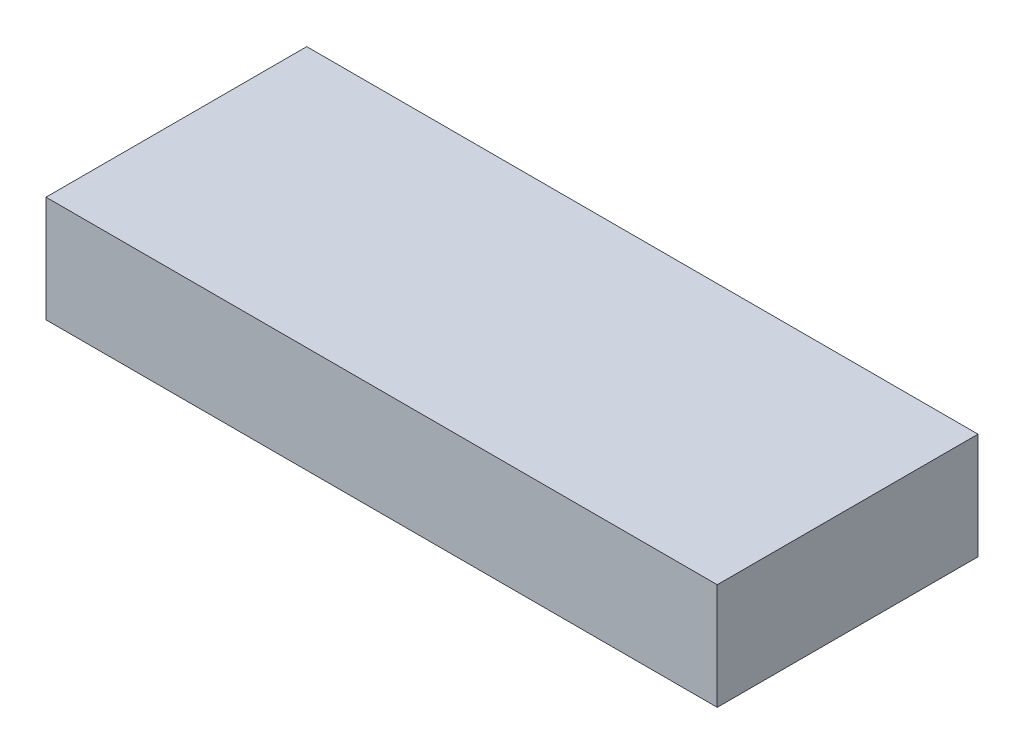
ISO-10303-21;
HEADER;
FILE_DESCRIPTION(('STEP AP214'),'2;1');
FILE_NAME('part.step','',(''),(''),'','','');
FILE_SCHEMA(('AUTOMOTIVE_DESIGN { 1 0 10303 214 1 1 1 1 }'));
ENDSEC;
DATA;
#1=APPLICATION_CONTEXT('core data for automotive mechanical design processes');
#2=APPLICATION_PROTOCOL_DEFINITION('international standard','automotive_design',2000,#1);
#3=PRODUCT_CONTEXT('',#1,'mechanical');
#4=PRODUCT('Part','Part','',(#3));
#5=PRODUCT_RELATED_PRODUCT_CATEGORY('part','',(#4));
#6=PRODUCT_DEFINITION_FORMATION('','',#4);
#7=PRODUCT_DEFINITION_CONTEXT('part definition',#1,'design');
#8=PRODUCT_DEFINITION('design','',#6,#7);
#9=PRODUCT_DEFINITION_SHAPE('','',#8);
#10=(LENGTH_UNIT() NAMED_UNIT(*) SI_UNIT(.MILLI.,.METRE.));
#11=(NAMED_UNIT(*) PLANE_ANGLE_UNIT() SI_UNIT($,.RADIAN.));
#12=(NAMED_UNIT(*) SI_UNIT($,.STERADIAN.) SOLID_ANGLE_UNIT());
#13=UNCERTAINTY_MEASURE_WITH_UNIT(LENGTH_MEASURE(1.E-05),#10,'distance_accuracy_value','');
#14=(GEOMETRIC_REPRESENTATION_CONTEXT(3) GLOBAL_UNCERTAINTY_ASSIGNED_CONTEXT((#13)) GLOBAL_UNIT_ASSIGNED_CONTEXT((#10,
#11,#12)) REPRESENTATION_CONTEXT('',''));
#15=CARTESIAN_POINT('',(0.,0.,0.));
#16=DIRECTION('',(0.,0.,1.));
#17=DIRECTION('',(1.,0.,0.));
#18=AXIS2_PLACEMENT_3D('',#15,#16,#17);
#19=CARTESIAN_POINT('',(-63.1856138719376,20.,-24.54560632862));
#20=DIRECTION('',(1.,0.,0.));
#21=DIRECTION('',(0.,0.,-1.));
#22=AXIS2_PLACEMENT_3D('',#19,#20,#21);
#23=PLANE('',#22);
#24=DIRECTION('',(0.,0.,1.));
#25=VECTOR('',#24,1.);
#26=CARTESIAN_POINT('',(-63.1856138719376,0.,-24.54560632862));
#27=LINE('',#26,#25);
#28=CARTESIAN_POINT('',(-63.1856138719376,0.,-24.54560632862));
#29=VERTEX_POINT('',#28);
#30=CARTESIAN_POINT('',(-63.1856138719376,0.,24.54560632862));
#31=VERTEX_POINT('',#30);
#32=EDGE_CURVE('E96',#29,#31,#27,.T.);
#33=ORIENTED_EDGE('',*,*,#32,.T.);
#34=DIRECTION('',(0.,-1.,0.));
#35=VECTOR('',#34,1.);
#36=CARTESIAN_POINT('',(-63.1856138719376,20.,24.54560632862));
#37=LINE('',#36,#35);
#38=CARTESIAN_POINT('',(-63.1856138719376,20.,24.54560632862));
#39=VERTEX_POINT('',#38);
#40=EDGE_CURVE('E11',#39,#31,#37,.T.);
#41=ORIENTED_EDGE('',*,*,#40,.F.);
#42=DIRECTION('',(0.,0.,1.));
#43=VECTOR('',#42,1.);
#44=CARTESIAN_POINT('',(-63.1856138719376,20.,-24.54560632862));
#45=LINE('',#44,#43);
#46=CARTESIAN_POINT('',(-63.1856138719376,20.,-24.54560632862));
#47=VERTEX_POINT('',#46);
#48=EDGE_CURVE('E84',#47,#39,#45,.T.);
#49=ORIENTED_EDGE('',*,*,#48,.F.);
#50=DIRECTION('',(0.,-1.,0.));
#51=VECTOR('',#50,1.);
#52=CARTESIAN_POINT('',(-63.1856138719376,20.,-24.54560632862));
#53=LINE('',#52,#51);
#54=EDGE_CURVE('E92',#47,#29,#53,.T.);
#55=ORIENTED_EDGE('',*,*,#54,.T.);
#56=EDGE_LOOP('',(#33,#41,#49,#55));
#57=FACE_BOUND('',#56,.T.);
#58=ADVANCED_FACE('F33',(#57),#23,.F.);
#59=CARTESIAN_POINT('',(63.1856138719376,20.,24.54560632862));
#60=DIRECTION('',(0.,0.,-1.));
#61=DIRECTION('',(-1.,0.,0.));
#62=AXIS2_PLACEMENT_3D('',#59,#60,#61);
#63=PLANE('',#62);
#64=DIRECTION('',(1.,0.,0.));
#65=VECTOR('',#64,1.);
#66=CARTESIAN_POINT('',(63.1856138719376,0.,24.54560632862));
#67=LINE('',#66,#65);
#68=CARTESIAN_POINT('',(63.1856138719376,0.,24.54560632862));
#69=VERTEX_POINT('',#68);
#70=EDGE_CURVE('E88',#31,#69,#67,.T.);
#71=ORIENTED_EDGE('',*,*,#70,.T.);
#72=DIRECTION('',(0.,-1.,0.));
#73=VECTOR('',#72,1.);
#74=CARTESIAN_POINT('',(63.1856138719376,20.,24.54560632862));
#75=LINE('',#74,#73);
#76=CARTESIAN_POINT('',(63.1856138719376,20.,24.54560632862));
#77=VERTEX_POINT('',#76);
#78=EDGE_CURVE('E41',#77,#69,#75,.T.);
#79=ORIENTED_EDGE('',*,*,#78,.F.);
#80=DIRECTION('',(1.,0.,0.));
#81=VECTOR('',#80,1.);
#82=CARTESIAN_POINT('',(63.1856138719376,20.,24.54560632862));
#83=LINE('',#82,#81);
#84=EDGE_CURVE('E79',#39,#77,#83,.T.);
#85=ORIENTED_EDGE('',*,*,#84,.F.);
#86=ORIENTED_EDGE('',*,*,#40,.T.);
#87=EDGE_LOOP('',(#71,#79,#85,#86));
#88=FACE_BOUND('',#87,.T.);
#89=ADVANCED_FACE('F87',(#88),#63,.F.);
#90=CARTESIAN_POINT('',(63.1856138719376,20.,-24.54560632862));
#91=DIRECTION('',(-1.,0.,0.));
#92=DIRECTION('',(0.,0.,1.));
#93=AXIS2_PLACEMENT_3D('',#90,#91,#92);
#94=PLANE('',#93);
#95=DIRECTION('',(0.,0.,-1.));
#96=VECTOR('',#95,1.);
#97=CARTESIAN_POINT('',(63.1856138719376,0.,-24.54560632862));
#98=LINE('',#97,#96);
#99=CARTESIAN_POINT('',(63.1856138719376,0.,-24.54560632862));
#100=VERTEX_POINT('',#99);
#101=EDGE_CURVE('E66',#69,#100,#98,.T.);
#102=ORIENTED_EDGE('',*,*,#101,.T.);
#103=DIRECTION('',(0.,-1.,0.));
#104=VECTOR('',#103,1.);
#105=CARTESIAN_POINT('',(63.1856138719376,20.,-24.54560632862));
#106=LINE('',#105,#104);
#107=CARTESIAN_POINT('',(63.1856138719376,20.,-24.54560632862));
#108=VERTEX_POINT('',#107);
#109=EDGE_CURVE('E89',#108,#100,#106,.T.);
#110=ORIENTED_EDGE('',*,*,#109,.F.);
#111=DIRECTION('',(0.,0.,-1.));
#112=VECTOR('',#111,1.);
#113=CARTESIAN_POINT('',(63.1856138719376,20.,-24.54560632862));
#114=LINE('',#113,#112);
#115=EDGE_CURVE('E82',#77,#108,#114,.T.);
#116=ORIENTED_EDGE('',*,*,#115,.F.);
#117=ORIENTED_EDGE('',*,*,#78,.T.);
#118=EDGE_LOOP('',(#102,#110,#116,#117));
#119=FACE_BOUND('',#118,.T.);
#120=ADVANCED_FACE('F90',(#119),#94,.F.);
#121=CARTESIAN_POINT('',(63.1856138719376,20.,-24.54560632862));
#122=DIRECTION('',(0.,0.,1.));
#123=DIRECTION('',(1.,0.,0.));
#124=AXIS2_PLACEMENT_3D('',#121,#122,#123);
#125=PLANE('',#124);
#126=DIRECTION('',(-1.,0.,0.));
#127=VECTOR('',#126,1.);
#128=CARTESIAN_POINT('',(63.1856138719376,0.,-24.54560632862));
#129=LINE('',#128,#127);
#130=EDGE_CURVE('E72',#100,#29,#129,.T.);
#131=ORIENTED_EDGE('',*,*,#130,.T.);
#132=ORIENTED_EDGE('',*,*,#54,.F.);
#133=DIRECTION('',(-1.,0.,0.));
#134=VECTOR('',#133,1.);
#135=CARTESIAN_POINT('',(63.1856138719376,20.,-24.54560632862));
#136=LINE('',#135,#134);
#137=EDGE_CURVE('E49',#108,#47,#136,.T.);
#138=ORIENTED_EDGE('',*,*,#137,.F.);
#139=ORIENTED_EDGE('',*,*,#109,.T.);
#140=EDGE_LOOP('',(#131,#132,#138,#139));
#141=FACE_BOUND('',#140,.T.);
#142=ADVANCED_FACE('F103',(#141),#125,.F.);
#143=CARTESIAN_POINT('',(0.,20.,0.));
#144=DIRECTION('',(0.,-1.,0.));
#145=DIRECTION('',(0.,0.,-1.));
#146=AXIS2_PLACEMENT_3D('',#143,#144,#145);
#147=PLANE('',#146);
#148=ORIENTED_EDGE('',*,*,#48,.T.);
#149=ORIENTED_EDGE('',*,*,#84,.T.);
#150=ORIENTED_EDGE('',*,*,#115,.T.);
#151=ORIENTED_EDGE('',*,*,#137,.T.);
#152=EDGE_LOOP('',(#148,#149,#150,#151));
#153=FACE_BOUND('',#152,.T.);
#154=ADVANCED_FACE('F80',(#153),#147,.F.);
#155=CARTESIAN_POINT('',(0.,0.,0.));
#156=DIRECTION('',(0.,-1.,0.));
#157=DIRECTION('',(0.,0.,-1.));
#158=AXIS2_PLACEMENT_3D('',#155,#156,#157);
#159=PLANE('',#158);
#160=ORIENTED_EDGE('',*,*,#32,.F.);
#161=ORIENTED_EDGE('',*,*,#130,.F.);
#162=ORIENTED_EDGE('',*,*,#101,.F.);
#163=ORIENTED_EDGE('',*,*,#70,.F.);
#164=EDGE_LOOP('',(#160,#161,#162,#163));
#165=FACE_BOUND('',#164,.T.);
#166=ADVANCED_FACE('F106',(#165),#159,.T.);
#167=CLOSED_SHELL('',(#58,#89,#120,#142,#154,#166));
#168=MANIFOLD_SOLID_BREP('B2',#167);
#169=ADVANCED_BREP_SHAPE_REPRESENTATION('',(#18,#168),#14);
#170=SHAPE_DEFINITION_REPRESENTATION(#9,#169);
ENDSEC;
END-ISO-10303-21;
